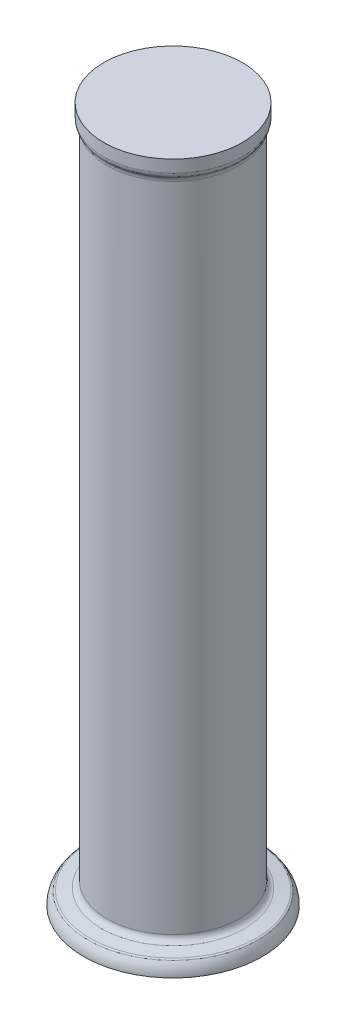
ISO-10303-21;
HEADER;
FILE_DESCRIPTION(('STEP AP214'),'2;1');
FILE_NAME('part.step','',(''),(''),'','','');
FILE_SCHEMA(('AUTOMOTIVE_DESIGN { 1 0 10303 214 1 1 1 1 }'));
ENDSEC;
DATA;
#1=APPLICATION_CONTEXT('core data for automotive mechanical design processes');
#2=APPLICATION_PROTOCOL_DEFINITION('international standard','automotive_design',2000,#1);
#3=PRODUCT_CONTEXT('',#1,'mechanical');
#4=PRODUCT('Part','Part','',(#3));
#5=PRODUCT_RELATED_PRODUCT_CATEGORY('part','',(#4));
#6=PRODUCT_DEFINITION_FORMATION('','',#4);
#7=PRODUCT_DEFINITION_CONTEXT('part definition',#1,'design');
#8=PRODUCT_DEFINITION('design','',#6,#7);
#9=PRODUCT_DEFINITION_SHAPE('','',#8);
#10=(LENGTH_UNIT() NAMED_UNIT(*) SI_UNIT(.MILLI.,.METRE.));
#11=(NAMED_UNIT(*) PLANE_ANGLE_UNIT() SI_UNIT($,.RADIAN.));
#12=(NAMED_UNIT(*) SI_UNIT($,.STERADIAN.) SOLID_ANGLE_UNIT());
#13=UNCERTAINTY_MEASURE_WITH_UNIT(LENGTH_MEASURE(1.E-05),#10,'distance_accuracy_value','');
#14=(GEOMETRIC_REPRESENTATION_CONTEXT(3) GLOBAL_UNCERTAINTY_ASSIGNED_CONTEXT((#13)) GLOBAL_UNIT_ASSIGNED_CONTEXT((#10,
#11,#12)) REPRESENTATION_CONTEXT('',''));
#15=CARTESIAN_POINT('',(0.,0.,0.));
#16=DIRECTION('',(0.,0.,1.));
#17=DIRECTION('',(1.,0.,0.));
#18=AXIS2_PLACEMENT_3D('',#15,#16,#17);
#19=CARTESIAN_POINT('',(-58.0000000000025,807.,48.1907105375432));
#20=DIRECTION('',(0.,-1.,0.));
#21=DIRECTION('',(1.,0.,0.));
#22=AXIS2_PLACEMENT_3D('',#19,#20,#21);
#23=PLANE('',#22);
#24=CARTESIAN_POINT('',(-2.50022225145585E-12,807.,48.1907105375428));
#25=DIRECTION('',(0.,-1.,0.));
#26=DIRECTION('',(-1.,0.,0.));
#27=AXIS2_PLACEMENT_3D('',#24,#25,#26);
#28=CIRCLE('',#27,58.);
#29=CARTESIAN_POINT('',(-58.0000000000025,807.,48.1907105375428));
#30=VERTEX_POINT('',#29);
#31=EDGE_CURVE('E37',#30,#30,#28,.T.);
#32=ORIENTED_EDGE('',*,*,#31,.T.);
#33=EDGE_LOOP('',(#32));
#34=FACE_BOUND('',#33,.T.);
#35=ADVANCED_FACE('F34',(#34),#23,.T.);
#36=CARTESIAN_POINT('',(-2.50022225145585E-12,807.,48.1907105375428));
#37=DIRECTION('',(0.,1.,0.));
#38=DIRECTION('',(-1.,0.,0.));
#39=AXIS2_PLACEMENT_3D('',#36,#37,#38);
#40=TOROIDAL_SURFACE('',#39,45.7295895079795,12.2704104920205);
#41=CARTESIAN_POINT('',(-2.53243799590855E-12,814.875398098358,48.1907105375428));
#42=DIRECTION('',(0.,-1.,0.));
#43=DIRECTION('',(0.,0.,-1.));
#44=AXIS2_PLACEMENT_3D('',#41,#42,#43);
#45=CIRCLE('',#44,55.1392164099921);
#46=CARTESIAN_POINT('',(-2.91198232714116E-12,814.875398098358,-6.94850587244929));
#47=VERTEX_POINT('',#46);
#48=EDGE_CURVE('E80',#47,#47,#45,.T.);
#49=ORIENTED_EDGE('',*,*,#48,.T.);
#50=EDGE_LOOP('',(#49));
#51=FACE_BOUND('',#50,.T.);
#52=ORIENTED_EDGE('',*,*,#31,.F.);
#53=EDGE_LOOP('',(#52));
#54=FACE_BOUND('',#53,.T.);
#55=ADVANCED_FACE('F91',(#51,#54),#40,.T.);
#56=CARTESIAN_POINT('',(-45.0006854519809,1258.3,48.1907105375429));
#57=DIRECTION('',(0.,1.,0.));
#58=DIRECTION('',(0.,0.,-1.));
#59=AXIS2_PLACEMENT_3D('',#56,#57,#58);
#60=PLANE('',#59);
#61=CARTESIAN_POINT('',(-4.31946145518238E-12,1258.30000000002,48.1907105375426));
#62=DIRECTION('',(0.,-1.,0.));
#63=DIRECTION('',(-1.,0.,0.));
#64=AXIS2_PLACEMENT_3D('',#61,#62,#63);
#65=CIRCLE('',#64,45.0006854519766);
#66=CARTESIAN_POINT('',(-45.0006854519809,1258.30000000002,48.1907105375426));
#67=VERTEX_POINT('',#66);
#68=EDGE_CURVE('E77',#67,#67,#65,.F.);
#69=ORIENTED_EDGE('',*,*,#68,.T.);
#70=EDGE_LOOP('',(#69));
#71=FACE_BOUND('',#70,.T.);
#72=ADVANCED_FACE('F88',(#71),#60,.T.);
#73=CARTESIAN_POINT('',(-2.52775578246656E-12,813.71797430624,48.1907105375428));
#74=DIRECTION('',(0.,1.,0.));
#75=DIRECTION('',(0.,0.,-1.));
#76=AXIS2_PLACEMENT_3D('',#73,#74,#75);
#77=TOROIDAL_SURFACE('',#76,53.7563115821574,1.80334566775437);
#78=CARTESIAN_POINT('',(-2.52864396088626E-12,815.493923101205,48.1907105375428));
#79=DIRECTION('',(0.,1.,0.));
#80=DIRECTION('',(1.,0.,0.));
#81=AXIS2_PLACEMENT_3D('',#78,#79,#80);
#82=CIRCLE('',#81,54.0694592710667);
#83=CARTESIAN_POINT('',(54.0694592710642,815.493923101206,48.1907105375424));
#84=VERTEX_POINT('',#83);
#85=EDGE_CURVE('E74',#84,#84,#82,.F.);
#86=ORIENTED_EDGE('',*,*,#85,.T.);
#87=EDGE_LOOP('',(#86));
#88=FACE_BOUND('',#87,.T.);
#89=ORIENTED_EDGE('',*,*,#48,.F.);
#90=EDGE_LOOP('',(#89));
#91=FACE_BOUND('',#90,.T.);
#92=ADVANCED_FACE('F83',(#88,#91),#77,.T.);
#93=CARTESIAN_POINT('',(-4.31946145518225E-12,1258.29999999999,48.1907105375426));
#94=DIRECTION('',(0.,1.,0.));
#95=DIRECTION('',(-1.,0.,0.));
#96=AXIS2_PLACEMENT_3D('',#93,#94,#95);
#97=CONICAL_SURFACE('',#96,45.0006854519766,8.56814967798771E-05);
#98=ORIENTED_EDGE('',*,*,#68,.F.);
#99=EDGE_LOOP('',(#98));
#100=FACE_BOUND('',#99,.T.);
#101=CARTESIAN_POINT('',(-4.29345274776142E-12,1250.29957159252,48.1907105375426));
#102=DIRECTION('',(0.,-1.,0.));
#103=DIRECTION('',(0.,0.,-1.));
#104=AXIS2_PLACEMENT_3D('',#101,#102,#103);
#105=CIRCLE('',#104,44.9999999701759);
#106=CARTESIAN_POINT('',(-4.60320497142655E-12,1250.29957159252,3.19071056736676));
#107=VERTEX_POINT('',#106);
#108=EDGE_CURVE('E71',#107,#107,#105,.F.);
#109=ORIENTED_EDGE('',*,*,#108,.T.);
#110=EDGE_LOOP('',(#109));
#111=FACE_BOUND('',#110,.T.);
#112=ADVANCED_FACE('F87',(#100,#111),#97,.T.);
#113=CARTESIAN_POINT('',(-2.52922682797418E-12,815.493923101205,48.1907105375428));
#114=DIRECTION('',(0.,-1.,0.));
#115=DIRECTION('',(1.,0.,0.));
#116=AXIS2_PLACEMENT_3D('',#113,#114,#115);
#117=CONICAL_SURFACE('',#116,54.0694592710667,1.39626340159545);
#118=ORIENTED_EDGE('',*,*,#85,.F.);
#119=EDGE_LOOP('',(#118));
#120=FACE_BOUND('',#119,.T.);
#121=CARTESIAN_POINT('',(-2.54024182466655E-12,816.862934945208,48.1907105375428));
#122=DIRECTION('',(0.,-1.,0.));
#123=DIRECTION('',(-1.,0.,0.));
#124=AXIS2_PLACEMENT_3D('',#121,#122,#123);
#125=CIRCLE('',#124,46.3054072893322);
#126=CARTESIAN_POINT('',(-46.3054072893347,816.862934945208,48.1907105375431));
#127=VERTEX_POINT('',#126);
#128=EDGE_CURVE('E69',#127,#127,#125,.F.);
#129=ORIENTED_EDGE('',*,*,#128,.F.);
#130=EDGE_LOOP('',(#129));
#131=FACE_BOUND('',#130,.T.);
#132=ADVANCED_FACE('F129',(#120,#131),#117,.T.);
#133=CARTESIAN_POINT('',(-4.29345448083041E-12,1250.3,48.1907105375426));
#134=DIRECTION('',(0.,1.,0.));
#135=DIRECTION('',(0.,0.,-1.));
#136=AXIS2_PLACEMENT_3D('',#133,#134,#135);
#137=TOROIDAL_SURFACE('',#136,40.0000000000001,4.99999998852913);
#138=ORIENTED_EDGE('',*,*,#108,.F.);
#139=EDGE_LOOP('',(#138));
#140=FACE_BOUND('',#139,.T.);
#141=CARTESIAN_POINT('',(-4.2745043615844E-12,1247.30000000138,48.1907105375426));
#142=DIRECTION('',(0.,-1.,0.));
#143=DIRECTION('',(-1.,0.,0.));
#144=AXIS2_PLACEMENT_3D('',#141,#142,#143);
#145=CIRCLE('',#144,43.9999999981647);
#146=CARTESIAN_POINT('',(-43.9999999981689,1247.30000000138,48.190710537543));
#147=VERTEX_POINT('',#146);
#148=EDGE_CURVE('E46',#147,#147,#145,.T.);
#149=ORIENTED_EDGE('',*,*,#148,.F.);
#150=EDGE_LOOP('',(#149));
#151=FACE_BOUND('',#150,.T.);
#152=ADVANCED_FACE('F62',(#140,#151),#137,.T.);
#153=CARTESIAN_POINT('',(-2.55617749189696E-12,820.802165957257,48.1907105375428));
#154=DIRECTION('',(0.,1.,0.));
#155=DIRECTION('',(-1.,0.,0.));
#156=AXIS2_PLACEMENT_3D('',#153,#154,#155);
#157=TOROIDAL_SURFACE('',#156,47.,4.);
#158=ORIENTED_EDGE('',*,*,#128,.T.);
#159=EDGE_LOOP('',(#158));
#160=FACE_BOUND('',#159,.T.);
#161=CARTESIAN_POINT('',(-2.5498399416421E-12,820.802165957257,48.1907105375428));
#162=DIRECTION('',(0.,1.,0.));
#163=DIRECTION('',(1.,0.,0.));
#164=AXIS2_PLACEMENT_3D('',#161,#162,#163);
#165=CIRCLE('',#164,43.);
#166=CARTESIAN_POINT('',(42.9999999999975,820.802165957257,48.1907105375428));
#167=VERTEX_POINT('',#166);
#168=EDGE_CURVE('E41',#167,#167,#165,.F.);
#169=ORIENTED_EDGE('',*,*,#168,.T.);
#170=EDGE_LOOP('',(#169));
#171=FACE_BOUND('',#170,.T.);
#172=ADVANCED_FACE('F58',(#160,#171),#157,.F.);
#173=CARTESIAN_POINT('',(-4.2623682361409E-12,1244.3,48.1907105375426));
#174=DIRECTION('',(0.,1.,0.));
#175=DIRECTION('',(-1.,0.,0.));
#176=AXIS2_PLACEMENT_3D('',#173,#174,#175);
#177=TOROIDAL_SURFACE('',#176,48.,5.00000000229416);
#178=CARTESIAN_POINT('',(-4.2630475538541E-12,1244.3,48.1907105375426));
#179=DIRECTION('',(0.,1.,0.));
#180=DIRECTION('',(1.,0.,0.));
#181=AXIS2_PLACEMENT_3D('',#178,#179,#180);
#182=CIRCLE('',#181,43.);
#183=CARTESIAN_POINT('',(42.9999999999957,1244.3,48.1907105375426));
#184=VERTEX_POINT('',#183);
#185=EDGE_CURVE('E10',#184,#184,#182,.T.);
#186=ORIENTED_EDGE('',*,*,#185,.T.);
#187=EDGE_LOOP('',(#186));
#188=FACE_BOUND('',#187,.T.);
#189=ORIENTED_EDGE('',*,*,#148,.T.);
#190=EDGE_LOOP('',(#189));
#191=FACE_BOUND('',#190,.T.);
#192=ADVANCED_FACE('F53',(#188,#191),#177,.F.);
#193=CARTESIAN_POINT('',(-2.49400500251795E-12,807.,48.1907105375428));
#194=DIRECTION('',(0.,-1.,0.));
#195=DIRECTION('',(1.,0.,0.));
#196=AXIS2_PLACEMENT_3D('',#193,#194,#195);
#197=CYLINDRICAL_SURFACE('',#196,43.);
#198=ORIENTED_EDGE('',*,*,#168,.F.);
#199=EDGE_LOOP('',(#198));
#200=FACE_BOUND('',#199,.T.);
#201=ORIENTED_EDGE('',*,*,#185,.F.);
#202=EDGE_LOOP('',(#201));
#203=FACE_BOUND('',#202,.T.);
#204=ADVANCED_FACE('F57',(#200,#203),#197,.T.);
#205=CLOSED_SHELL('',(#35,#55,#72,#92,#112,#132,#152,#172,#192,#204));
#206=MANIFOLD_SOLID_BREP('B2',#205);
#207=ADVANCED_BREP_SHAPE_REPRESENTATION('',(#18,#206),#14);
#208=SHAPE_DEFINITION_REPRESENTATION(#9,#207);
ENDSEC;
END-ISO-10303-21;
